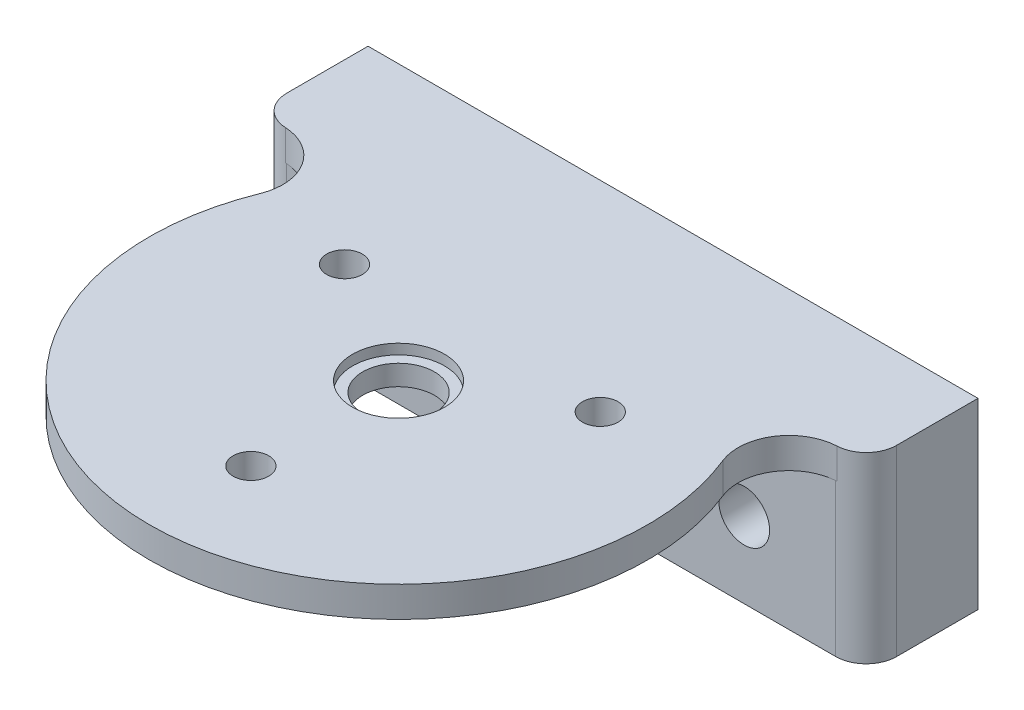
ISO-10303-21;
HEADER;
FILE_DESCRIPTION(('STEP AP214'),'2;1');
FILE_NAME('part.step','',(''),(''),'','','');
FILE_SCHEMA(('AUTOMOTIVE_DESIGN { 1 0 10303 214 1 1 1 1 }'));
ENDSEC;
DATA;
#1=APPLICATION_CONTEXT('core data for automotive mechanical design processes');
#2=APPLICATION_PROTOCOL_DEFINITION('international standard','automotive_design',2000,#1);
#3=PRODUCT_CONTEXT('',#1,'mechanical');
#4=PRODUCT('Part','Part','',(#3));
#5=PRODUCT_RELATED_PRODUCT_CATEGORY('part','',(#4));
#6=PRODUCT_DEFINITION_FORMATION('','',#4);
#7=PRODUCT_DEFINITION_CONTEXT('part definition',#1,'design');
#8=PRODUCT_DEFINITION('design','',#6,#7);
#9=PRODUCT_DEFINITION_SHAPE('','',#8);
#10=(LENGTH_UNIT() NAMED_UNIT(*) SI_UNIT(.MILLI.,.METRE.));
#11=(NAMED_UNIT(*) PLANE_ANGLE_UNIT() SI_UNIT($,.RADIAN.));
#12=(NAMED_UNIT(*) SI_UNIT($,.STERADIAN.) SOLID_ANGLE_UNIT());
#13=UNCERTAINTY_MEASURE_WITH_UNIT(LENGTH_MEASURE(1.E-05),#10,'distance_accuracy_value','');
#14=(GEOMETRIC_REPRESENTATION_CONTEXT(3) GLOBAL_UNCERTAINTY_ASSIGNED_CONTEXT((#13)) GLOBAL_UNIT_ASSIGNED_CONTEXT((#10,
#11,#12)) REPRESENTATION_CONTEXT('',''));
#15=CARTESIAN_POINT('',(0.,0.,0.));
#16=DIRECTION('',(0.,0.,1.));
#17=DIRECTION('',(1.,0.,0.));
#18=AXIS2_PLACEMENT_3D('',#15,#16,#17);
#19=CARTESIAN_POINT('',(0.,2.,0.));
#20=DIRECTION('',(0.,-1.,0.));
#21=DIRECTION('',(0.,0.,-1.));
#22=AXIS2_PLACEMENT_3D('',#19,#20,#21);
#23=CYLINDRICAL_SURFACE('',#22,3.525);
#24=CARTESIAN_POINT('',(0.,2.,0.));
#25=DIRECTION('',(0.,1.,0.));
#26=DIRECTION('',(0.,0.,1.));
#27=AXIS2_PLACEMENT_3D('',#24,#25,#26);
#28=CIRCLE('',#27,3.525);
#29=CARTESIAN_POINT('',(0.,2.,3.525));
#30=VERTEX_POINT('',#29);
#31=EDGE_CURVE('E182',#30,#30,#28,.T.);
#32=ORIENTED_EDGE('',*,*,#31,.T.);
#33=EDGE_LOOP('',(#32));
#34=FACE_BOUND('',#33,.T.);
#35=CARTESIAN_POINT('',(0.,0.,0.));
#36=DIRECTION('',(0.,1.,0.));
#37=DIRECTION('',(0.,0.,1.));
#38=AXIS2_PLACEMENT_3D('',#35,#36,#37);
#39=CIRCLE('',#38,3.525);
#40=CARTESIAN_POINT('',(0.,0.,3.525));
#41=VERTEX_POINT('',#40);
#42=EDGE_CURVE('E181',#41,#41,#39,.T.);
#43=ORIENTED_EDGE('',*,*,#42,.F.);
#44=EDGE_LOOP('',(#43));
#45=FACE_BOUND('',#44,.T.);
#46=ADVANCED_FACE('F39',(#34,#45),#23,.F.);
#47=CARTESIAN_POINT('',(0.,2.,0.));
#48=DIRECTION('',(0.,1.,0.));
#49=DIRECTION('',(0.,0.,1.));
#50=AXIS2_PLACEMENT_3D('',#47,#48,#49);
#51=PLANE('',#50);
#52=ORIENTED_EDGE('',*,*,#31,.F.);
#53=EDGE_LOOP('',(#52));
#54=FACE_BOUND('',#53,.T.);
#55=CARTESIAN_POINT('',(0.,2.,0.));
#56=DIRECTION('',(0.,1.,0.));
#57=DIRECTION('',(0.,0.,1.));
#58=AXIS2_PLACEMENT_3D('',#55,#56,#57);
#59=CIRCLE('',#58,4.525);
#60=CARTESIAN_POINT('',(0.,2.,4.525));
#61=VERTEX_POINT('',#60);
#62=EDGE_CURVE('E176',#61,#61,#59,.F.);
#63=ORIENTED_EDGE('',*,*,#62,.F.);
#64=EDGE_LOOP('',(#63));
#65=FACE_BOUND('',#64,.T.);
#66=ADVANCED_FACE('F287',(#54,#65),#51,.T.);
#67=CARTESIAN_POINT('',(0.,0.,0.));
#68=DIRECTION('',(0.,1.,0.));
#69=DIRECTION('',(0.,0.,1.));
#70=AXIS2_PLACEMENT_3D('',#67,#68,#69);
#71=PLANE('',#70);
#72=CARTESIAN_POINT('',(-12.5790189899689,0.,-7.26250000000006));
#73=DIRECTION('',(0.,1.,0.));
#74=DIRECTION('',(0.,0.,1.));
#75=AXIS2_PLACEMENT_3D('',#72,#73,#74);
#76=CIRCLE('',#75,1.75);
#77=CARTESIAN_POINT('',(-12.5790189899689,0.,-5.51250000000006));
#78=VERTEX_POINT('',#77);
#79=EDGE_CURVE('E160',#78,#78,#76,.T.);
#80=ORIENTED_EDGE('',*,*,#79,.T.);
#81=EDGE_LOOP('',(#80));
#82=FACE_BOUND('',#81,.T.);
#83=CARTESIAN_POINT('',(12.579018989969,0.,-7.26249999999989));
#84=DIRECTION('',(0.,1.,0.));
#85=DIRECTION('',(0.,0.,1.));
#86=AXIS2_PLACEMENT_3D('',#83,#84,#85);
#87=CIRCLE('',#86,1.75);
#88=CARTESIAN_POINT('',(12.579018989969,0.,-5.51249999999988));
#89=VERTEX_POINT('',#88);
#90=EDGE_CURVE('E155',#89,#89,#87,.T.);
#91=ORIENTED_EDGE('',*,*,#90,.T.);
#92=EDGE_LOOP('',(#91));
#93=FACE_BOUND('',#92,.T.);
#94=CARTESIAN_POINT('',(0.,0.,14.525));
#95=DIRECTION('',(0.,1.,0.));
#96=DIRECTION('',(0.,0.,1.));
#97=AXIS2_PLACEMENT_3D('',#94,#95,#96);
#98=CIRCLE('',#97,1.75);
#99=CARTESIAN_POINT('',(0.,0.,16.275));
#100=VERTEX_POINT('',#99);
#101=EDGE_CURVE('E166',#100,#100,#98,.T.);
#102=ORIENTED_EDGE('',*,*,#101,.T.);
#103=EDGE_LOOP('',(#102));
#104=FACE_BOUND('',#103,.T.);
#105=ORIENTED_EDGE('',*,*,#42,.T.);
#106=EDGE_LOOP('',(#105));
#107=FACE_BOUND('',#106,.T.);
#108=CARTESIAN_POINT('',(0.,0.,0.));
#109=DIRECTION('',(0.,1.,0.));
#110=DIRECTION('',(0.,0.,1.));
#111=AXIS2_PLACEMENT_3D('',#108,#109,#110);
#112=CIRCLE('',#111,24.525);
#113=CARTESIAN_POINT('',(-22.756080501628,0.,-9.1452952496586));
#114=VERTEX_POINT('',#113);
#115=CARTESIAN_POINT('',(22.756080501628,0.,-9.1452952496586));
#116=VERTEX_POINT('',#115);
#117=EDGE_CURVE('E170',#114,#116,#112,.T.);
#118=ORIENTED_EDGE('',*,*,#117,.F.);
#119=CARTESIAN_POINT('',(-27.3954445182697,0.,-11.0097795003535));
#120=DIRECTION('',(0.,1.,0.));
#121=DIRECTION('',(0.,0.,1.));
#122=AXIS2_PLACEMENT_3D('',#119,#120,#121);
#123=CIRCLE('',#122,5.);
#124=CARTESIAN_POINT('',(-27.1482916943512,0.,-16.0036673126326));
#125=VERTEX_POINT('',#124);
#126=EDGE_CURVE('E47',#114,#125,#123,.T.);
#127=ORIENTED_EDGE('',*,*,#126,.T.);
#128=CARTESIAN_POINT('',(-27.,0.,-19.));
#129=DIRECTION('',(0.,1.,0.));
#130=DIRECTION('',(0.,0.,1.));
#131=AXIS2_PLACEMENT_3D('',#128,#129,#130);
#132=CIRCLE('',#131,3.);
#133=CARTESIAN_POINT('',(-27.,0.,-16.));
#134=VERTEX_POINT('',#133);
#135=EDGE_CURVE('E218',#134,#125,#132,.F.);
#136=ORIENTED_EDGE('',*,*,#135,.F.);
#137=DIRECTION('',(1.,0.,0.));
#138=VECTOR('',#137,1.);
#139=CARTESIAN_POINT('',(0.,0.,-16.));
#140=LINE('',#139,#138);
#141=CARTESIAN_POINT('',(27.,0.,-16.));
#142=VERTEX_POINT('',#141);
#143=EDGE_CURVE('E54',#134,#142,#140,.T.);
#144=ORIENTED_EDGE('',*,*,#143,.T.);
#145=CARTESIAN_POINT('',(27.,0.,-19.));
#146=DIRECTION('',(0.,1.,0.));
#147=DIRECTION('',(0.,0.,1.));
#148=AXIS2_PLACEMENT_3D('',#145,#146,#147);
#149=CIRCLE('',#148,3.);
#150=CARTESIAN_POINT('',(27.1482916943512,0.,-16.0036673126326));
#151=VERTEX_POINT('',#150);
#152=EDGE_CURVE('E210',#151,#142,#149,.F.);
#153=ORIENTED_EDGE('',*,*,#152,.F.);
#154=CARTESIAN_POINT('',(27.3954445182697,0.,-11.0097795003535));
#155=DIRECTION('',(0.,1.,0.));
#156=DIRECTION('',(0.,0.,1.));
#157=AXIS2_PLACEMENT_3D('',#154,#155,#156);
#158=CIRCLE('',#157,5.);
#159=EDGE_CURVE('E222',#151,#116,#158,.T.);
#160=ORIENTED_EDGE('',*,*,#159,.T.);
#161=EDGE_LOOP('',(#118,#127,#136,#144,#153,#160));
#162=FACE_BOUND('',#161,.T.);
#163=ADVANCED_FACE('F224',(#82,#93,#104,#107,#162),#71,.F.);
#164=CARTESIAN_POINT('',(0.,73.3671752344003,0.));
#165=DIRECTION('',(0.,-1.,0.));
#166=DIRECTION('',(0.,0.,-1.));
#167=AXIS2_PLACEMENT_3D('',#164,#165,#166);
#168=CYLINDRICAL_SURFACE('',#167,4.525);
#169=ORIENTED_EDGE('',*,*,#62,.T.);
#170=EDGE_LOOP('',(#169));
#171=FACE_BOUND('',#170,.T.);
#172=CARTESIAN_POINT('',(0.,3.,0.));
#173=DIRECTION('',(0.,1.,0.));
#174=DIRECTION('',(0.,0.,1.));
#175=AXIS2_PLACEMENT_3D('',#172,#173,#174);
#176=CIRCLE('',#175,4.525);
#177=CARTESIAN_POINT('',(0.,3.,4.525));
#178=VERTEX_POINT('',#177);
#179=EDGE_CURVE('E169',#178,#178,#176,.T.);
#180=ORIENTED_EDGE('',*,*,#179,.T.);
#181=EDGE_LOOP('',(#180));
#182=FACE_BOUND('',#181,.T.);
#183=ADVANCED_FACE('F410',(#171,#182),#168,.F.);
#184=CARTESIAN_POINT('',(0.,73.3671752344003,0.));
#185=DIRECTION('',(0.,-1.,0.));
#186=DIRECTION('',(0.,0.,-1.));
#187=AXIS2_PLACEMENT_3D('',#184,#185,#186);
#188=CYLINDRICAL_SURFACE('',#187,24.525);
#189=ORIENTED_EDGE('',*,*,#117,.T.);
#190=DIRECTION('',(0.,-1.,0.));
#191=VECTOR('',#190,1.);
#192=CARTESIAN_POINT('',(22.756080501628,73.3671752344003,-9.1452952496586));
#193=LINE('',#192,#191);
#194=CARTESIAN_POINT('',(22.756080501628,3.,-9.1452952496586));
#195=VERTEX_POINT('',#194);
#196=EDGE_CURVE('E207',#116,#195,#193,.F.);
#197=ORIENTED_EDGE('',*,*,#196,.T.);
#198=CARTESIAN_POINT('',(0.,3.,0.));
#199=DIRECTION('',(0.,1.,0.));
#200=DIRECTION('',(0.,0.,1.));
#201=AXIS2_PLACEMENT_3D('',#198,#199,#200);
#202=CIRCLE('',#201,24.525);
#203=CARTESIAN_POINT('',(-22.756080501628,3.,-9.1452952496586));
#204=VERTEX_POINT('',#203);
#205=EDGE_CURVE('E173',#204,#195,#202,.T.);
#206=ORIENTED_EDGE('',*,*,#205,.F.);
#207=DIRECTION('',(0.,-1.,0.));
#208=VECTOR('',#207,1.);
#209=CARTESIAN_POINT('',(-22.756080501628,73.3671752344003,-9.14529524965861));
#210=LINE('',#209,#208);
#211=EDGE_CURVE('E204',#204,#114,#210,.T.);
#212=ORIENTED_EDGE('',*,*,#211,.T.);
#213=EDGE_LOOP('',(#189,#197,#206,#212));
#214=FACE_BOUND('',#213,.T.);
#215=ADVANCED_FACE('F229',(#214),#188,.T.);
#216=CARTESIAN_POINT('',(0.,3.,0.));
#217=DIRECTION('',(0.,1.,0.));
#218=DIRECTION('',(0.,0.,1.));
#219=AXIS2_PLACEMENT_3D('',#216,#217,#218);
#220=PLANE('',#219);
#221=DIRECTION('',(0.,0.,-1.));
#222=VECTOR('',#221,1.);
#223=CARTESIAN_POINT('',(-30.,3.,-27.));
#224=LINE('',#223,#222);
#225=CARTESIAN_POINT('',(-30.,3.,-19.));
#226=VERTEX_POINT('',#225);
#227=CARTESIAN_POINT('',(-30.,3.,-27.));
#228=VERTEX_POINT('',#227);
#229=EDGE_CURVE('E132',#226,#228,#224,.T.);
#230=ORIENTED_EDGE('',*,*,#229,.F.);
#231=CARTESIAN_POINT('',(-27.,3.,-19.));
#232=DIRECTION('',(0.,1.,0.));
#233=DIRECTION('',(0.,0.,1.));
#234=AXIS2_PLACEMENT_3D('',#231,#232,#233);
#235=CIRCLE('',#234,3.);
#236=CARTESIAN_POINT('',(-27.1482916943512,3.,-16.0036673126326));
#237=VERTEX_POINT('',#236);
#238=EDGE_CURVE('E198',#226,#237,#235,.T.);
#239=ORIENTED_EDGE('',*,*,#238,.T.);
#240=CARTESIAN_POINT('',(-27.3954445182697,3.,-11.0097795003535));
#241=DIRECTION('',(0.,1.,0.));
#242=DIRECTION('',(0.,0.,1.));
#243=AXIS2_PLACEMENT_3D('',#240,#241,#242);
#244=CIRCLE('',#243,5.);
#245=EDGE_CURVE('E12',#237,#204,#244,.F.);
#246=ORIENTED_EDGE('',*,*,#245,.T.);
#247=ORIENTED_EDGE('',*,*,#205,.T.);
#248=CARTESIAN_POINT('',(27.3954445182697,3.,-11.0097795003535));
#249=DIRECTION('',(0.,1.,0.));
#250=DIRECTION('',(0.,0.,1.));
#251=AXIS2_PLACEMENT_3D('',#248,#249,#250);
#252=CIRCLE('',#251,5.);
#253=CARTESIAN_POINT('',(27.1482916943512,3.,-16.0036673126326));
#254=VERTEX_POINT('',#253);
#255=EDGE_CURVE('E220',#195,#254,#252,.F.);
#256=ORIENTED_EDGE('',*,*,#255,.T.);
#257=CARTESIAN_POINT('',(27.,3.,-19.));
#258=DIRECTION('',(0.,1.,0.));
#259=DIRECTION('',(0.,0.,1.));
#260=AXIS2_PLACEMENT_3D('',#257,#258,#259);
#261=CIRCLE('',#260,3.);
#262=CARTESIAN_POINT('',(30.,3.,-19.));
#263=VERTEX_POINT('',#262);
#264=EDGE_CURVE('E196',#254,#263,#261,.T.);
#265=ORIENTED_EDGE('',*,*,#264,.T.);
#266=DIRECTION('',(0.,0.,1.));
#267=VECTOR('',#266,1.);
#268=CARTESIAN_POINT('',(30.,3.,-27.));
#269=LINE('',#268,#267);
#270=CARTESIAN_POINT('',(30.,3.,-27.));
#271=VERTEX_POINT('',#270);
#272=EDGE_CURVE('E145',#271,#263,#269,.T.);
#273=ORIENTED_EDGE('',*,*,#272,.F.);
#274=DIRECTION('',(1.,0.,0.));
#275=VECTOR('',#274,1.);
#276=CARTESIAN_POINT('',(-30.,3.,-27.));
#277=LINE('',#276,#275);
#278=EDGE_CURVE('E136',#228,#271,#277,.T.);
#279=ORIENTED_EDGE('',*,*,#278,.F.);
#280=EDGE_LOOP('',(#230,#239,#246,#247,#256,#265,#273,#279));
#281=FACE_BOUND('',#280,.T.);
#282=CARTESIAN_POINT('',(-12.5790189899689,3.,-7.26250000000006));
#283=DIRECTION('',(0.,1.,0.));
#284=DIRECTION('',(-0.866025403784436,0.,-0.500000000000004));
#285=AXIS2_PLACEMENT_3D('',#282,#283,#284);
#286=CIRCLE('',#285,1.75);
#287=CARTESIAN_POINT('',(-14.0945634465917,3.,-8.13750000000007));
#288=VERTEX_POINT('',#287);
#289=EDGE_CURVE('E152',#288,#288,#286,.T.);
#290=ORIENTED_EDGE('',*,*,#289,.F.);
#291=EDGE_LOOP('',(#290));
#292=FACE_BOUND('',#291,.T.);
#293=CARTESIAN_POINT('',(12.579018989969,3.,-7.26249999999989));
#294=DIRECTION('',(0.,1.,0.));
#295=DIRECTION('',(0.866025403784443,0.,-0.499999999999992));
#296=AXIS2_PLACEMENT_3D('',#293,#294,#295);
#297=CIRCLE('',#296,1.75);
#298=CARTESIAN_POINT('',(14.0945634465918,3.,-8.13749999999987));
#299=VERTEX_POINT('',#298);
#300=EDGE_CURVE('E151',#299,#299,#297,.T.);
#301=ORIENTED_EDGE('',*,*,#300,.F.);
#302=EDGE_LOOP('',(#301));
#303=FACE_BOUND('',#302,.T.);
#304=CARTESIAN_POINT('',(0.,3.,14.525));
#305=DIRECTION('',(0.,1.,0.));
#306=DIRECTION('',(0.,0.,1.));
#307=AXIS2_PLACEMENT_3D('',#304,#305,#306);
#308=CIRCLE('',#307,1.75);
#309=CARTESIAN_POINT('',(0.,3.,16.275));
#310=VERTEX_POINT('',#309);
#311=EDGE_CURVE('E163',#310,#310,#308,.T.);
#312=ORIENTED_EDGE('',*,*,#311,.F.);
#313=EDGE_LOOP('',(#312));
#314=FACE_BOUND('',#313,.T.);
#315=ORIENTED_EDGE('',*,*,#179,.F.);
#316=EDGE_LOOP('',(#315));
#317=FACE_BOUND('',#316,.T.);
#318=ADVANCED_FACE('F235',(#281,#292,#303,#314,#317),#220,.T.);
#319=CARTESIAN_POINT('',(0.,-1.5,14.525));
#320=DIRECTION('',(0.,1.,0.));
#321=DIRECTION('',(0.,0.,1.));
#322=AXIS2_PLACEMENT_3D('',#319,#320,#321);
#323=CYLINDRICAL_SURFACE('',#322,1.75);
#324=ORIENTED_EDGE('',*,*,#311,.T.);
#325=EDGE_LOOP('',(#324));
#326=FACE_BOUND('',#325,.T.);
#327=ORIENTED_EDGE('',*,*,#101,.F.);
#328=EDGE_LOOP('',(#327));
#329=FACE_BOUND('',#328,.T.);
#330=ADVANCED_FACE('F378',(#326,#329),#323,.F.);
#331=CARTESIAN_POINT('',(12.579018989969,-1.5,-7.26249999999989));
#332=DIRECTION('',(0.,1.,0.));
#333=DIRECTION('',(0.,0.,1.));
#334=AXIS2_PLACEMENT_3D('',#331,#332,#333);
#335=CYLINDRICAL_SURFACE('',#334,1.75);
#336=ORIENTED_EDGE('',*,*,#300,.T.);
#337=EDGE_LOOP('',(#336));
#338=FACE_BOUND('',#337,.T.);
#339=ORIENTED_EDGE('',*,*,#90,.F.);
#340=EDGE_LOOP('',(#339));
#341=FACE_BOUND('',#340,.T.);
#342=ADVANCED_FACE('F390',(#338,#341),#335,.F.);
#343=CARTESIAN_POINT('',(-12.5790189899689,-1.5,-7.26250000000006));
#344=DIRECTION('',(0.,1.,0.));
#345=DIRECTION('',(0.,0.,1.));
#346=AXIS2_PLACEMENT_3D('',#343,#344,#345);
#347=CYLINDRICAL_SURFACE('',#346,1.75);
#348=ORIENTED_EDGE('',*,*,#289,.T.);
#349=EDGE_LOOP('',(#348));
#350=FACE_BOUND('',#349,.T.);
#351=ORIENTED_EDGE('',*,*,#79,.F.);
#352=EDGE_LOOP('',(#351));
#353=FACE_BOUND('',#352,.T.);
#354=ADVANCED_FACE('F273',(#350,#353),#347,.F.);
#355=CARTESIAN_POINT('',(-30.,64.,-16.));
#356=DIRECTION('',(0.,0.,1.));
#357=DIRECTION('',(1.,0.,0.));
#358=AXIS2_PLACEMENT_3D('',#355,#356,#357);
#359=PLANE('',#358);
#360=CARTESIAN_POINT('',(-18.,-7.5,-16.));
#361=DIRECTION('',(0.,0.,1.));
#362=DIRECTION('',(1.,0.,0.));
#363=AXIS2_PLACEMENT_3D('',#360,#361,#362);
#364=CIRCLE('',#363,2.5);
#365=CARTESIAN_POINT('',(-15.5,-7.5,-16.));
#366=VERTEX_POINT('',#365);
#367=EDGE_CURVE('E245',#366,#366,#364,.T.);
#368=ORIENTED_EDGE('',*,*,#367,.F.);
#369=EDGE_LOOP('',(#368));
#370=FACE_BOUND('',#369,.T.);
#371=CARTESIAN_POINT('',(18.,-7.49999999999999,-16.));
#372=DIRECTION('',(0.,0.,1.));
#373=DIRECTION('',(-1.,0.,0.));
#374=AXIS2_PLACEMENT_3D('',#371,#372,#373);
#375=CIRCLE('',#374,2.5);
#376=CARTESIAN_POINT('',(15.5,-7.49999999999999,-16.));
#377=VERTEX_POINT('',#376);
#378=EDGE_CURVE('E254',#377,#377,#375,.T.);
#379=ORIENTED_EDGE('',*,*,#378,.F.);
#380=EDGE_LOOP('',(#379));
#381=FACE_BOUND('',#380,.T.);
#382=DIRECTION('',(0.,-1.,0.));
#383=VECTOR('',#382,1.);
#384=CARTESIAN_POINT('',(27.,64.,-16.));
#385=LINE('',#384,#383);
#386=CARTESIAN_POINT('',(27.,-15.,-16.));
#387=VERTEX_POINT('',#386);
#388=EDGE_CURVE('E185',#387,#142,#385,.F.);
#389=ORIENTED_EDGE('',*,*,#388,.T.);
#390=ORIENTED_EDGE('',*,*,#143,.F.);
#391=DIRECTION('',(0.,-1.,0.));
#392=VECTOR('',#391,1.);
#393=CARTESIAN_POINT('',(-27.,64.,-16.));
#394=LINE('',#393,#392);
#395=CARTESIAN_POINT('',(-27.,-15.,-16.));
#396=VERTEX_POINT('',#395);
#397=EDGE_CURVE('E189',#134,#396,#394,.T.);
#398=ORIENTED_EDGE('',*,*,#397,.T.);
#399=DIRECTION('',(-1.,0.,0.));
#400=VECTOR('',#399,1.);
#401=CARTESIAN_POINT('',(-30.,-15.,-16.));
#402=LINE('',#401,#400);
#403=EDGE_CURVE('E126',#387,#396,#402,.T.);
#404=ORIENTED_EDGE('',*,*,#403,.F.);
#405=EDGE_LOOP('',(#389,#390,#398,#404));
#406=FACE_BOUND('',#405,.T.);
#407=ADVANCED_FACE('F270',(#370,#381,#406),#359,.T.);
#408=CARTESIAN_POINT('',(-30.,64.,-27.));
#409=DIRECTION('',(-1.,0.,0.));
#410=DIRECTION('',(0.,0.,1.));
#411=AXIS2_PLACEMENT_3D('',#408,#409,#410);
#412=PLANE('',#411);
#413=DIRECTION('',(0.,0.,-1.));
#414=VECTOR('',#413,1.);
#415=CARTESIAN_POINT('',(-30.,-15.,-27.));
#416=LINE('',#415,#414);
#417=CARTESIAN_POINT('',(-30.,-15.,-19.));
#418=VERTEX_POINT('',#417);
#419=CARTESIAN_POINT('',(-30.,-15.,-27.));
#420=VERTEX_POINT('',#419);
#421=EDGE_CURVE('E114',#418,#420,#416,.T.);
#422=ORIENTED_EDGE('',*,*,#421,.F.);
#423=DIRECTION('',(0.,-1.,0.));
#424=VECTOR('',#423,1.);
#425=CARTESIAN_POINT('',(-30.,64.,-19.));
#426=LINE('',#425,#424);
#427=EDGE_CURVE('E194',#418,#226,#426,.F.);
#428=ORIENTED_EDGE('',*,*,#427,.T.);
#429=ORIENTED_EDGE('',*,*,#229,.T.);
#430=DIRECTION('',(0.,-1.,0.));
#431=VECTOR('',#430,1.);
#432=CARTESIAN_POINT('',(-30.,64.,-27.));
#433=LINE('',#432,#431);
#434=EDGE_CURVE('E129',#228,#420,#433,.T.);
#435=ORIENTED_EDGE('',*,*,#434,.T.);
#436=EDGE_LOOP('',(#422,#428,#429,#435));
#437=FACE_BOUND('',#436,.T.);
#438=ADVANCED_FACE('F130',(#437),#412,.T.);
#439=CARTESIAN_POINT('',(-30.,64.,-27.));
#440=DIRECTION('',(0.,0.,-1.));
#441=DIRECTION('',(-1.,0.,0.));
#442=AXIS2_PLACEMENT_3D('',#439,#440,#441);
#443=PLANE('',#442);
#444=CARTESIAN_POINT('',(-18.,-7.5,-27.));
#445=DIRECTION('',(0.,0.,-1.));
#446=DIRECTION('',(-1.,0.,0.));
#447=AXIS2_PLACEMENT_3D('',#444,#445,#446);
#448=CIRCLE('',#447,2.5);
#449=CARTESIAN_POINT('',(-20.5,-7.5,-27.));
#450=VERTEX_POINT('',#449);
#451=EDGE_CURVE('E248',#450,#450,#448,.F.);
#452=ORIENTED_EDGE('',*,*,#451,.T.);
#453=EDGE_LOOP('',(#452));
#454=FACE_BOUND('',#453,.T.);
#455=CARTESIAN_POINT('',(18.,-7.49999999999999,-27.));
#456=DIRECTION('',(0.,0.,-1.));
#457=DIRECTION('',(-1.,0.,0.));
#458=AXIS2_PLACEMENT_3D('',#455,#456,#457);
#459=CIRCLE('',#458,2.5);
#460=CARTESIAN_POINT('',(15.5,-7.49999999999999,-27.));
#461=VERTEX_POINT('',#460);
#462=EDGE_CURVE('E251',#461,#461,#459,.F.);
#463=ORIENTED_EDGE('',*,*,#462,.T.);
#464=EDGE_LOOP('',(#463));
#465=FACE_BOUND('',#464,.T.);
#466=ORIENTED_EDGE('',*,*,#434,.F.);
#467=ORIENTED_EDGE('',*,*,#278,.T.);
#468=DIRECTION('',(0.,-1.,0.));
#469=VECTOR('',#468,1.);
#470=CARTESIAN_POINT('',(30.,64.,-27.));
#471=LINE('',#470,#469);
#472=CARTESIAN_POINT('',(30.,-15.,-27.));
#473=VERTEX_POINT('',#472);
#474=EDGE_CURVE('E140',#271,#473,#471,.T.);
#475=ORIENTED_EDGE('',*,*,#474,.T.);
#476=DIRECTION('',(1.,0.,0.));
#477=VECTOR('',#476,1.);
#478=CARTESIAN_POINT('',(-30.,-15.,-27.));
#479=LINE('',#478,#477);
#480=EDGE_CURVE('E120',#420,#473,#479,.T.);
#481=ORIENTED_EDGE('',*,*,#480,.F.);
#482=EDGE_LOOP('',(#466,#467,#475,#481));
#483=FACE_BOUND('',#482,.T.);
#484=ADVANCED_FACE('F138',(#454,#465,#483),#443,.T.);
#485=CARTESIAN_POINT('',(30.,64.,-27.));
#486=DIRECTION('',(1.,0.,0.));
#487=DIRECTION('',(0.,0.,-1.));
#488=AXIS2_PLACEMENT_3D('',#485,#486,#487);
#489=PLANE('',#488);
#490=ORIENTED_EDGE('',*,*,#272,.T.);
#491=DIRECTION('',(0.,-1.,0.));
#492=VECTOR('',#491,1.);
#493=CARTESIAN_POINT('',(30.,64.,-19.));
#494=LINE('',#493,#492);
#495=CARTESIAN_POINT('',(30.,-15.,-19.));
#496=VERTEX_POINT('',#495);
#497=EDGE_CURVE('E201',#263,#496,#494,.T.);
#498=ORIENTED_EDGE('',*,*,#497,.T.);
#499=DIRECTION('',(0.,0.,1.));
#500=VECTOR('',#499,1.);
#501=CARTESIAN_POINT('',(30.,-15.,-27.));
#502=LINE('',#501,#500);
#503=EDGE_CURVE('E243',#473,#496,#502,.T.);
#504=ORIENTED_EDGE('',*,*,#503,.F.);
#505=ORIENTED_EDGE('',*,*,#474,.F.);
#506=EDGE_LOOP('',(#490,#498,#504,#505));
#507=FACE_BOUND('',#506,.T.);
#508=ADVANCED_FACE('F242',(#507),#489,.T.);
#509=CARTESIAN_POINT('',(0.,-15.,0.));
#510=DIRECTION('',(0.,1.,0.));
#511=DIRECTION('',(0.,0.,1.));
#512=AXIS2_PLACEMENT_3D('',#509,#510,#511);
#513=PLANE('',#512);
#514=ORIENTED_EDGE('',*,*,#403,.T.);
#515=CARTESIAN_POINT('',(-27.,-15.,-19.));
#516=DIRECTION('',(0.,1.,0.));
#517=DIRECTION('',(0.,0.,1.));
#518=AXIS2_PLACEMENT_3D('',#515,#516,#517);
#519=CIRCLE('',#518,3.);
#520=EDGE_CURVE('E123',#396,#418,#519,.F.);
#521=ORIENTED_EDGE('',*,*,#520,.T.);
#522=ORIENTED_EDGE('',*,*,#421,.T.);
#523=ORIENTED_EDGE('',*,*,#480,.T.);
#524=ORIENTED_EDGE('',*,*,#503,.T.);
#525=CARTESIAN_POINT('',(27.,-15.,-19.));
#526=DIRECTION('',(0.,1.,0.));
#527=DIRECTION('',(0.,0.,1.));
#528=AXIS2_PLACEMENT_3D('',#525,#526,#527);
#529=CIRCLE('',#528,3.);
#530=EDGE_CURVE('E191',#496,#387,#529,.F.);
#531=ORIENTED_EDGE('',*,*,#530,.T.);
#532=EDGE_LOOP('',(#514,#521,#522,#523,#524,#531));
#533=FACE_BOUND('',#532,.T.);
#534=ADVANCED_FACE('F117',(#533),#513,.F.);
#535=CARTESIAN_POINT('',(18.,-7.49999999999999,-27.001));
#536=DIRECTION('',(0.,0.,1.));
#537=DIRECTION('',(1.,0.,0.));
#538=AXIS2_PLACEMENT_3D('',#535,#536,#537);
#539=CYLINDRICAL_SURFACE('',#538,2.5);
#540=ORIENTED_EDGE('',*,*,#462,.F.);
#541=EDGE_LOOP('',(#540));
#542=FACE_BOUND('',#541,.T.);
#543=ORIENTED_EDGE('',*,*,#378,.T.);
#544=EDGE_LOOP('',(#543));
#545=FACE_BOUND('',#544,.T.);
#546=ADVANCED_FACE('F266',(#542,#545),#539,.F.);
#547=CARTESIAN_POINT('',(-18.,-7.5,-27.001));
#548=DIRECTION('',(0.,0.,1.));
#549=DIRECTION('',(1.,0.,0.));
#550=AXIS2_PLACEMENT_3D('',#547,#548,#549);
#551=CYLINDRICAL_SURFACE('',#550,2.5);
#552=ORIENTED_EDGE('',*,*,#451,.F.);
#553=EDGE_LOOP('',(#552));
#554=FACE_BOUND('',#553,.T.);
#555=ORIENTED_EDGE('',*,*,#367,.T.);
#556=EDGE_LOOP('',(#555));
#557=FACE_BOUND('',#556,.T.);
#558=ADVANCED_FACE('F262',(#554,#557),#551,.F.);
#559=CARTESIAN_POINT('',(-27.,64.,-19.));
#560=DIRECTION('',(0.,-1.,0.));
#561=DIRECTION('',(0.,0.,-1.));
#562=AXIS2_PLACEMENT_3D('',#559,#560,#561);
#563=CYLINDRICAL_SURFACE('',#562,3.);
#564=ORIENTED_EDGE('',*,*,#397,.F.);
#565=ORIENTED_EDGE('',*,*,#135,.T.);
#566=DIRECTION('',(0.,-1.,0.));
#567=VECTOR('',#566,1.);
#568=CARTESIAN_POINT('',(-27.1482916943512,64.,-16.0036673126326));
#569=LINE('',#568,#567);
#570=EDGE_CURVE('E216',#125,#237,#569,.F.);
#571=ORIENTED_EDGE('',*,*,#570,.T.);
#572=ORIENTED_EDGE('',*,*,#238,.F.);
#573=ORIENTED_EDGE('',*,*,#427,.F.);
#574=ORIENTED_EDGE('',*,*,#520,.F.);
#575=EDGE_LOOP('',(#564,#565,#571,#572,#573,#574));
#576=FACE_BOUND('',#575,.T.);
#577=ADVANCED_FACE('F265',(#576),#563,.T.);
#578=CARTESIAN_POINT('',(27.,64.,-19.));
#579=DIRECTION('',(0.,-1.,0.));
#580=DIRECTION('',(0.,0.,-1.));
#581=AXIS2_PLACEMENT_3D('',#578,#579,#580);
#582=CYLINDRICAL_SURFACE('',#581,3.);
#583=ORIENTED_EDGE('',*,*,#264,.F.);
#584=DIRECTION('',(0.,-1.,0.));
#585=VECTOR('',#584,1.);
#586=CARTESIAN_POINT('',(27.1482916943512,64.,-16.0036673126326));
#587=LINE('',#586,#585);
#588=EDGE_CURVE('E213',#254,#151,#587,.T.);
#589=ORIENTED_EDGE('',*,*,#588,.T.);
#590=ORIENTED_EDGE('',*,*,#152,.T.);
#591=ORIENTED_EDGE('',*,*,#388,.F.);
#592=ORIENTED_EDGE('',*,*,#530,.F.);
#593=ORIENTED_EDGE('',*,*,#497,.F.);
#594=EDGE_LOOP('',(#583,#589,#590,#591,#592,#593));
#595=FACE_BOUND('',#594,.T.);
#596=ADVANCED_FACE('F239',(#595),#582,.T.);
#597=CARTESIAN_POINT('',(27.3954445182697,64.,-11.0097795003535));
#598=DIRECTION('',(0.,-1.,0.));
#599=DIRECTION('',(0.,0.,-1.));
#600=AXIS2_PLACEMENT_3D('',#597,#598,#599);
#601=CYLINDRICAL_SURFACE('',#600,5.);
#602=ORIENTED_EDGE('',*,*,#159,.F.);
#603=ORIENTED_EDGE('',*,*,#588,.F.);
#604=ORIENTED_EDGE('',*,*,#255,.F.);
#605=ORIENTED_EDGE('',*,*,#196,.F.);
#606=EDGE_LOOP('',(#602,#603,#604,#605));
#607=FACE_BOUND('',#606,.T.);
#608=ADVANCED_FACE('F232',(#607),#601,.F.);
#609=CARTESIAN_POINT('',(-27.3954445182697,64.,-11.0097795003535));
#610=DIRECTION('',(0.,1.,0.));
#611=DIRECTION('',(0.,0.,1.));
#612=AXIS2_PLACEMENT_3D('',#609,#610,#611);
#613=CYLINDRICAL_SURFACE('',#612,5.);
#614=ORIENTED_EDGE('',*,*,#245,.F.);
#615=ORIENTED_EDGE('',*,*,#570,.F.);
#616=ORIENTED_EDGE('',*,*,#126,.F.);
#617=ORIENTED_EDGE('',*,*,#211,.F.);
#618=EDGE_LOOP('',(#614,#615,#616,#617));
#619=FACE_BOUND('',#618,.T.);
#620=ADVANCED_FACE('F41',(#619),#613,.F.);
#621=CLOSED_SHELL('',(#46,#66,#163,#183,#215,#318,#330,#342,#354,#407,#438,#484,#508,#534,#546,
#558,#577,#596,#608,#620));
#622=MANIFOLD_SOLID_BREP('B2',#621);
#623=ADVANCED_BREP_SHAPE_REPRESENTATION('',(#18,#622),#14);
#624=SHAPE_DEFINITION_REPRESENTATION(#9,#623);
ENDSEC;
END-ISO-10303-21;
